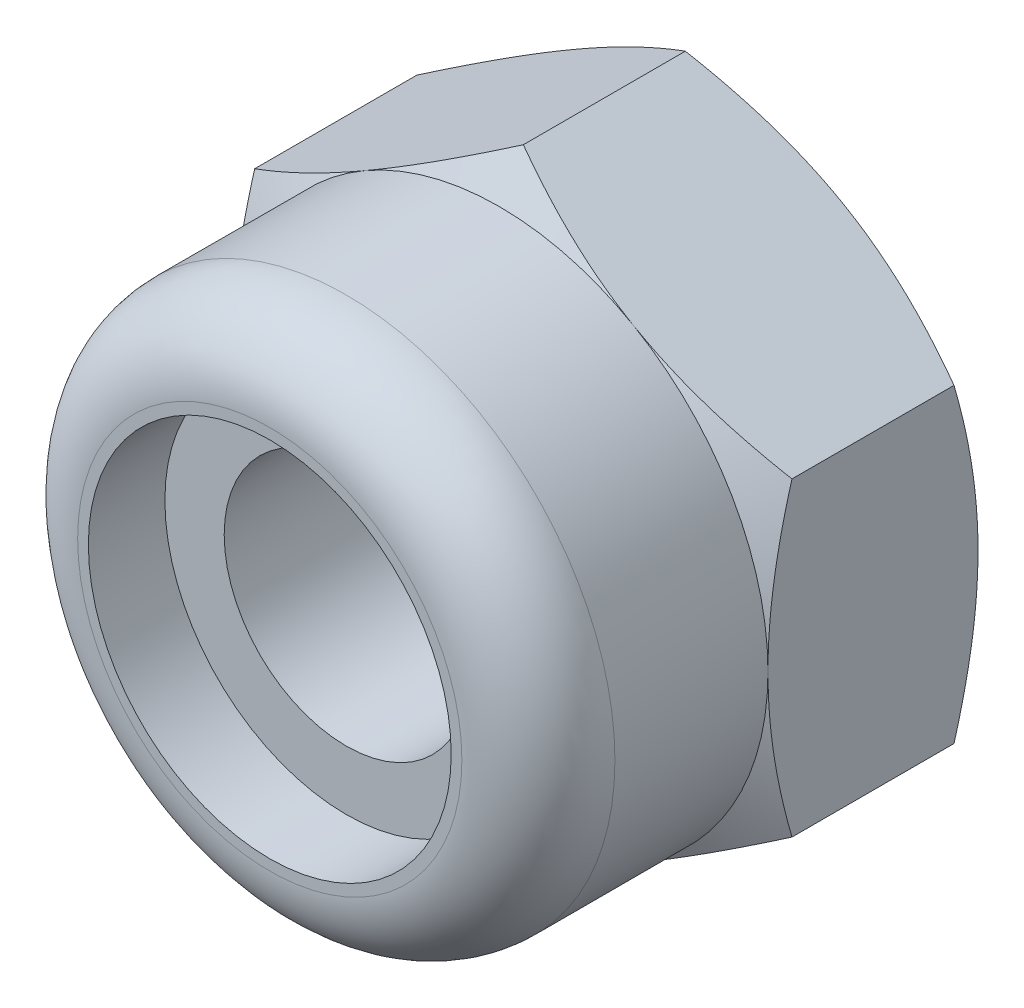
ISO-10303-21;
HEADER;
FILE_DESCRIPTION(('STEP AP214'),'2;1');
FILE_NAME('part.step','',(''),(''),'','','');
FILE_SCHEMA(('AUTOMOTIVE_DESIGN { 1 0 10303 214 1 1 1 1 }'));
ENDSEC;
DATA;
#1=APPLICATION_CONTEXT('core data for automotive mechanical design processes');
#2=APPLICATION_PROTOCOL_DEFINITION('international standard','automotive_design',2000,#1);
#3=PRODUCT_CONTEXT('',#1,'mechanical');
#4=PRODUCT('Part','Part','',(#3));
#5=PRODUCT_RELATED_PRODUCT_CATEGORY('part','',(#4));
#6=PRODUCT_DEFINITION_FORMATION('','',#4);
#7=PRODUCT_DEFINITION_CONTEXT('part definition',#1,'design');
#8=PRODUCT_DEFINITION('design','',#6,#7);
#9=PRODUCT_DEFINITION_SHAPE('','',#8);
#10=(LENGTH_UNIT() NAMED_UNIT(*) SI_UNIT(.MILLI.,.METRE.));
#11=(NAMED_UNIT(*) PLANE_ANGLE_UNIT() SI_UNIT($,.RADIAN.));
#12=(NAMED_UNIT(*) SI_UNIT($,.STERADIAN.) SOLID_ANGLE_UNIT());
#13=UNCERTAINTY_MEASURE_WITH_UNIT(LENGTH_MEASURE(1.E-05),#10,'distance_accuracy_value','');
#14=(GEOMETRIC_REPRESENTATION_CONTEXT(3) GLOBAL_UNCERTAINTY_ASSIGNED_CONTEXT((#13)) GLOBAL_UNIT_ASSIGNED_CONTEXT((#10,
#11,#12)) REPRESENTATION_CONTEXT('',''));
#15=CARTESIAN_POINT('',(0.,0.,0.));
#16=DIRECTION('',(0.,0.,1.));
#17=DIRECTION('',(1.,0.,0.));
#18=AXIS2_PLACEMENT_3D('',#15,#16,#17);
#19=CARTESIAN_POINT('',(-4.52279526300001,-0.465265331741155,0.28753924332247));
#20=DIRECTION('',(0.,0.,1.));
#21=DIRECTION('',(1.,0.,0.));
#22=AXIS2_PLACEMENT_3D('',#19,#20,#21);
#23=CYLINDRICAL_SURFACE('',#22,1.25);
#24=CARTESIAN_POINT('',(-4.52279526299978,-0.465265331740697,4.00420590998917));
#25=DIRECTION('',(0.,0.,1.));
#26=DIRECTION('',(1.,0.,0.));
#27=AXIS2_PLACEMENT_3D('',#24,#25,#26);
#28=CIRCLE('',#27,1.25);
#29=CARTESIAN_POINT('',(-3.27279526299978,-0.465265331740704,4.00420590998917));
#30=VERTEX_POINT('',#29);
#31=EDGE_CURVE('E262',#30,#30,#28,.T.);
#32=ORIENTED_EDGE('',*,*,#31,.T.);
#33=EDGE_LOOP('',(#32));
#34=FACE_BOUND('',#33,.T.);
#35=CARTESIAN_POINT('',(-4.52279526300002,-0.465265331740822,0.487991127874943));
#36=DIRECTION('',(0.,0.,-1.));
#37=DIRECTION('',(-1.,0.,0.));
#38=AXIS2_PLACEMENT_3D('',#35,#36,#37);
#39=CIRCLE('',#38,1.25);
#40=CARTESIAN_POINT('',(-5.77279526300003,-0.465265331740815,0.487991127874943));
#41=VERTEX_POINT('',#40);
#42=EDGE_CURVE('E21',#41,#41,#39,.F.);
#43=ORIENTED_EDGE('',*,*,#42,.F.);
#44=EDGE_LOOP('',(#43));
#45=FACE_BOUND('',#44,.T.);
#46=ADVANCED_FACE('F16',(#34,#45),#23,.F.);
#47=CARTESIAN_POINT('',(-4.52279526300015,2.7101611488022,0.287539243322487));
#48=DIRECTION('',(-0.500000000000012,0.866025403784441,0.));
#49=DIRECTION('',(-0.866025403784434,-0.500000000000005,0.));
#50=AXIS2_PLACEMENT_3D('',#47,#48,#49);
#51=PLANE('',#50);
#52=DIRECTION('',(0.,0.,1.));
#53=VECTOR('',#52,1.);
#54=CARTESIAN_POINT('',(-7.27279526300008,1.12244790853057,0.287539243322497));
#55=LINE('',#54,#53);
#56=CARTESIAN_POINT('',(-7.27279526300001,1.12244790853065,0.533159336384339));
#57=VERTEX_POINT('',#56);
#58=CARTESIAN_POINT('',(-7.272795263,1.12244790853071,2.19191915026062));
#59=VERTEX_POINT('',#58);
#60=EDGE_CURVE('E235',#57,#59,#55,.T.);
#61=ORIENTED_EDGE('',*,*,#60,.T.);
#62=CARTESIAN_POINT('',(-7.27299526300001,1.12233243847681,2.19185247995772));
#63=CARTESIAN_POINT('',(-7.15214604234014,1.19210476855622,2.23215158107315));
#64=CARTESIAN_POINT('',(-7.03025366037744,1.26247936809459,2.26880234072473));
#65=CARTESIAN_POINT('',(-6.78435813627221,1.40444721512929,2.33277706035258));
#66=CARTESIAN_POINT('',(-6.66035062442625,1.47604298547509,2.36007838764789));
#67=CARTESIAN_POINT('',(-6.41387246502418,1.61834721715523,2.40257749802826));
#68=CARTESIAN_POINT('',(-6.29143974441272,1.68903378135788,2.4180581246999));
#69=CARTESIAN_POINT('',(-6.04599812063124,1.83073956891846,2.43653984595246));
#70=CARTESIAN_POINT('',(-5.92299010976726,1.90175827710327,2.43955624385986));
#71=CARTESIAN_POINT('',(-5.69313647638939,2.0344643342082,2.43328609789392));
#72=CARTESIAN_POINT('',(-5.58625647174616,2.09617153365995,2.42553908904571));
#73=CARTESIAN_POINT('',(-5.37319279566542,2.2191839043997,2.40098406225803));
#74=CARTESIAN_POINT('',(-5.26700986135127,2.28048865010932,2.38416765367183));
#75=CARTESIAN_POINT('',(-5.05350677360696,2.40375471529131,2.34212732097645));
#76=CARTESIAN_POINT('',(-4.94621364685729,2.46570043090244,2.31672516263517));
#77=CARTESIAN_POINT('',(-4.73322778371607,2.5886678763206,2.25907201748243));
#78=CARTESIAN_POINT('',(-4.62753231797346,2.64969118191922,2.22683458002344));
#79=CARTESIAN_POINT('',(-4.5225952630001,2.71027661885606,2.19185247995772));
#80=B_SPLINE_CURVE_WITH_KNOTS('',3,(#62,#63,#64,#65,#66,#67,#68,#69,#70,#71,#72,#73,#74,#75,#76,
#77,#78,#79),.UNSPECIFIED.,.F.,.F.,(4,2,2,2,2,2,2,2,4),(0.,0.435912828725841,0.872873557116254,
1.29901931904661,1.72464171213559,2.09526089052924,2.46622354066363,2.84541551798549,
3.22386274754518),.UNSPECIFIED.);
#81=CARTESIAN_POINT('',(-5.89779526300013,1.91630452866622,2.43753924332248));
#82=VERTEX_POINT('',#81);
#83=EDGE_CURVE('E41',#59,#82,#80,.T.);
#84=ORIENTED_EDGE('',*,*,#83,.T.);
#85=CARTESIAN_POINT('',(-4.52279526300001,2.71016114880226,2.19191915026065));
#86=VERTEX_POINT('',#85);
#87=EDGE_CURVE('E184',#82,#86,#80,.T.);
#88=ORIENTED_EDGE('',*,*,#87,.T.);
#89=DIRECTION('',(0.,0.,1.));
#90=VECTOR('',#89,1.);
#91=CARTESIAN_POINT('',(-4.52279526300015,2.7101611488022,0.287539243322487));
#92=LINE('',#91,#90);
#93=CARTESIAN_POINT('',(-4.52279526300016,2.71016114880211,0.533159336384332));
#94=VERTEX_POINT('',#93);
#95=EDGE_CURVE('E221',#94,#86,#92,.T.);
#96=ORIENTED_EDGE('',*,*,#95,.F.);
#97=CARTESIAN_POINT('',(-7.272995263,1.12233243847676,0.533226006687242));
#98=CARTESIAN_POINT('',(-7.15214604234013,1.19210476855622,0.492926905571858));
#99=CARTESIAN_POINT('',(-7.03025366037742,1.2624793680946,0.456276145920294));
#100=CARTESIAN_POINT('',(-6.78435813627216,1.40444721512932,0.392301426292456));
#101=CARTESIAN_POINT('',(-6.66035062442618,1.47604298547511,0.365000098997142));
#102=CARTESIAN_POINT('',(-6.4138724650241,1.61834721715529,0.322500988616805));
#103=CARTESIAN_POINT('',(-6.29143974441264,1.68903378135798,0.3070203619452));
#104=CARTESIAN_POINT('',(-6.04599812063109,1.83073956891849,0.288538640692581));
#105=CARTESIAN_POINT('',(-5.92299010976704,1.90175827710319,0.285522242785084));
#106=CARTESIAN_POINT('',(-5.69313647638918,2.03446433420813,0.291792388751067));
#107=CARTESIAN_POINT('',(-5.58625647174602,2.09617153365998,0.299539397599372));
#108=CARTESIAN_POINT('',(-5.37319279566534,2.21918390439979,0.324094424387134));
#109=CARTESIAN_POINT('',(-5.26700986135119,2.28048865010938,0.34091083297331));
#110=CARTESIAN_POINT('',(-5.05350677360688,2.40375471529134,0.38295116566868));
#111=CARTESIAN_POINT('',(-4.94621364685721,2.46570043090247,0.40835332400998));
#112=CARTESIAN_POINT('',(-4.73322778371602,2.58866787632064,0.466006469162703));
#113=CARTESIAN_POINT('',(-4.62753231797342,2.64969118191927,0.498243906621648));
#114=CARTESIAN_POINT('',(-4.52259526300005,2.71027661885612,0.53322600668726));
#115=B_SPLINE_CURVE_WITH_KNOTS('',3,(#97,#98,#99,#100,#101,#102,#103,#104,#105,#106,#107,#108,
#109,#110,#111,#112,#113,#114),.UNSPECIFIED.,.F.,.F.,(4,2,2,2,2,2,2,2,4),(0.,0.435912828725867,
0.872873557116336,1.29901931904673,1.72464171213574,2.09526089052936,2.46622354066373,
2.84541551798557,3.22386274754522),.UNSPECIFIED.);
#116=CARTESIAN_POINT('',(-5.89779526300012,1.91630452866633,0.287539243322497));
#117=VERTEX_POINT('',#116);
#118=EDGE_CURVE('E237',#117,#94,#115,.T.);
#119=ORIENTED_EDGE('',*,*,#118,.F.);
#120=EDGE_CURVE('E215',#57,#117,#115,.T.);
#121=ORIENTED_EDGE('',*,*,#120,.F.);
#122=EDGE_LOOP('',(#61,#84,#88,#96,#119,#121));
#123=FACE_BOUND('',#122,.T.);
#124=ADVANCED_FACE('F18',(#123),#51,.T.);
#125=CARTESIAN_POINT('',(-1.77279526300001,1.12244790853079,0.287539243322487));
#126=DIRECTION('',(0.500000000000005,0.866025403784436,0.));
#127=DIRECTION('',(-0.866025403784435,0.500000000000014,0.));
#128=AXIS2_PLACEMENT_3D('',#125,#126,#127);
#129=PLANE('',#128);
#130=ORIENTED_EDGE('',*,*,#95,.T.);
#131=CARTESIAN_POINT('',(-4.52299526299989,2.71027661885583,2.19185247995771));
#132=CARTESIAN_POINT('',(-4.40214604233993,2.64050428877661,2.23215158107316));
#133=CARTESIAN_POINT('',(-4.28025366037721,2.57012968923831,2.26880234072475));
#134=CARTESIAN_POINT('',(-4.03435813627198,2.42816184220366,2.33277706035259));
#135=CARTESIAN_POINT('',(-3.91035062442605,2.35656607185784,2.3600783876479));
#136=CARTESIAN_POINT('',(-3.66387246502398,2.21426184017773,2.40257749802825));
#137=CARTESIAN_POINT('',(-3.54143974441251,2.14357527597513,2.41805812469988));
#138=CARTESIAN_POINT('',(-3.29599812063111,2.00186948841446,2.43653984595245));
#139=CARTESIAN_POINT('',(-3.17299010976723,1.93085078022951,2.43955624385988));
#140=CARTESIAN_POINT('',(-2.94313647638934,1.79814472312461,2.43328609789392));
#141=CARTESIAN_POINT('',(-2.83625647174603,1.73643752367298,2.42553908904569));
#142=CARTESIAN_POINT('',(-2.62319279566521,1.61342515293331,2.40098406225798));
#143=CARTESIAN_POINT('',(-2.51700986135107,1.55212040722364,2.38416765367179));
#144=CARTESIAN_POINT('',(-2.30350677360674,1.42885434204162,2.3421273209764));
#145=CARTESIAN_POINT('',(-2.19621364685704,1.36690862643051,2.3167251626351));
#146=CARTESIAN_POINT('',(-1.98322778371582,1.2439411810123,2.25907201748236));
#147=CARTESIAN_POINT('',(-1.87753231797323,1.18291787541361,2.2268345800234));
#148=CARTESIAN_POINT('',(-1.77259526299994,1.12233243847658,2.19185247995774));
#149=B_SPLINE_CURVE_WITH_KNOTS('',3,(#131,#132,#133,#134,#135,#136,#137,#138,#139,#140,#141,
#142,#143,#144,#145,#146,#147,#148),.UNSPECIFIED.,.F.,.F.,(4,2,2,2,2,2,2,2,4),(0.,
0.435912828725797,0.872873557116175,1.29901931904649,1.72464171213543,2.09526089052913,
2.46622354066357,2.84541551798547,3.2238627475452),.UNSPECIFIED.);
#150=CARTESIAN_POINT('',(-3.14779526299993,1.91630452866635,2.43753924332247));
#151=VERTEX_POINT('',#150);
#152=EDGE_CURVE('E193',#86,#151,#149,.T.);
#153=ORIENTED_EDGE('',*,*,#152,.T.);
#154=CARTESIAN_POINT('',(-1.772795263,1.12244790853064,2.19191915026063));
#155=VERTEX_POINT('',#154);
#156=EDGE_CURVE('E185',#151,#155,#149,.T.);
#157=ORIENTED_EDGE('',*,*,#156,.T.);
#158=DIRECTION('',(0.,0.,1.));
#159=VECTOR('',#158,1.);
#160=CARTESIAN_POINT('',(-1.77279526300001,1.12244790853079,0.287539243322487));
#161=LINE('',#160,#159);
#162=CARTESIAN_POINT('',(-1.772795263,1.12244790853065,0.533159336384381));
#163=VERTEX_POINT('',#162);
#164=EDGE_CURVE('E225',#163,#155,#161,.T.);
#165=ORIENTED_EDGE('',*,*,#164,.F.);
#166=CARTESIAN_POINT('',(-4.52299526299997,2.71027661885592,0.533226006687249));
#167=CARTESIAN_POINT('',(-4.40214604233999,2.64050428877664,0.492926905571915));
#168=CARTESIAN_POINT('',(-4.28025366037725,2.57012968923833,0.456276145920368));
#169=CARTESIAN_POINT('',(-4.03435813627197,2.42816184220366,0.392301426292535));
#170=CARTESIAN_POINT('',(-3.91035062442602,2.35656607185784,0.365000098997208));
#171=CARTESIAN_POINT('',(-3.66387246502394,2.21426184017768,0.322500988616852));
#172=CARTESIAN_POINT('',(-3.54143974441246,2.14357527597503,0.307020361945238));
#173=CARTESIAN_POINT('',(-3.29599812063098,2.00186948841445,0.288538640692602));
#174=CARTESIAN_POINT('',(-3.172990109767,1.93085078022963,0.285522242785096));
#175=CARTESIAN_POINT('',(-2.94313647638913,1.7981447231247,0.291792388751057));
#176=CARTESIAN_POINT('',(-2.8362564717459,1.73643752367296,0.299539397599352));
#177=CARTESIAN_POINT('',(-2.62319279566516,1.61342515293322,0.324094424387098));
#178=CARTESIAN_POINT('',(-2.51700986135101,1.55212040722359,0.340910832973269));
#179=CARTESIAN_POINT('',(-2.3035067736067,1.4288543420416,0.382951165668625));
#180=CARTESIAN_POINT('',(-2.19621364685701,1.36690862643049,0.408353324009916));
#181=CARTESIAN_POINT('',(-1.98322778371581,1.24394118101229,0.466006469162645));
#182=CARTESIAN_POINT('',(-1.87753231797322,1.18291787541363,0.498243906621607));
#183=CARTESIAN_POINT('',(-1.7725952629999,1.12233243847669,0.533226006687263));
#184=B_SPLINE_CURVE_WITH_KNOTS('',3,(#166,#167,#168,#169,#170,#171,#172,#173,#174,#175,#176,
#177,#178,#179,#180,#181,#182,#183),.UNSPECIFIED.,.F.,.F.,(4,2,2,2,2,2,2,2,4),(0.,
0.435912828725845,0.872873557116295,1.29901931904667,1.72464171213566,2.09526089052931,
2.46622354066371,2.84541551798557,3.22386274754525),.UNSPECIFIED.);
#185=CARTESIAN_POINT('',(-3.14779526299994,1.91630452866631,0.28753924332249));
#186=VERTEX_POINT('',#185);
#187=EDGE_CURVE('E206',#186,#163,#184,.T.);
#188=ORIENTED_EDGE('',*,*,#187,.F.);
#189=EDGE_CURVE('E213',#94,#186,#184,.T.);
#190=ORIENTED_EDGE('',*,*,#189,.F.);
#191=EDGE_LOOP('',(#130,#153,#157,#165,#188,#190));
#192=FACE_BOUND('',#191,.T.);
#193=ADVANCED_FACE('F196',(#192),#129,.T.);
#194=CARTESIAN_POINT('',(-1.77279526300001,1.12244790853079,0.287539243322487));
#195=DIRECTION('',(-1.,0.,0.));
#196=DIRECTION('',(0.,0.,1.));
#197=AXIS2_PLACEMENT_3D('',#194,#195,#196);
#198=PLANE('',#197);
#199=CARTESIAN_POINT('',(-1.77279526299997,-4.6761148248379,1.12159080371955));
#200=CARTESIAN_POINT('',(-1.77279526300002,-4.55537427388197,1.1799393071701));
#201=CARTESIAN_POINT('',(-1.77279526300003,-4.43434825239614,1.2377077782047));
#202=CARTESIAN_POINT('',(-1.77279526300004,-4.19157091458946,1.35175320489919));
#203=CARTESIAN_POINT('',(-1.77279526300004,-4.06981947710303,1.40802990231979));
#204=CARTESIAN_POINT('',(-1.77279526300003,-3.82477926208457,1.51905679996952));
#205=CARTESIAN_POINT('',(-1.77279526300003,-3.70148567410538,1.57379642171644));
#206=CARTESIAN_POINT('',(-1.77279526300003,-3.45388513312844,1.68092446584583));
#207=CARTESIAN_POINT('',(-1.77279526300003,-3.32957823335282,1.73331301078553));
#208=CARTESIAN_POINT('',(-1.77279526300003,-3.07821019061271,1.83573567117618));
#209=CARTESIAN_POINT('',(-1.77279526300003,-2.95113396989753,1.88573298542391));
#210=CARTESIAN_POINT('',(-1.77279526300003,-2.69548265345638,1.98181183453771));
#211=CARTESIAN_POINT('',(-1.77279526300003,-2.56690739277461,2.02789293374536));
#212=CARTESIAN_POINT('',(-1.77279526300003,-2.30831751973564,2.11490116627608));
#213=CARTESIAN_POINT('',(-1.77279526300002,-2.17830663226679,2.1558392569084));
#214=CARTESIAN_POINT('',(-1.77279526300003,-1.91643658236246,2.23123193569803));
#215=CARTESIAN_POINT('',(-1.77279526300003,-1.78457801864303,2.26568857416973));
#216=CARTESIAN_POINT('',(-1.77279526300003,-1.51892255654114,2.3264455717916));
#217=CARTESIAN_POINT('',(-1.77279526300003,-1.38512515195859,2.35274375922727));
#218=CARTESIAN_POINT('',(-1.77279526300002,-1.11591720577835,2.39541320612571));
#219=CARTESIAN_POINT('',(-1.77279526300001,-0.980506662754571,2.41178445681182));
#220=CARTESIAN_POINT('',(-1.77279526300003,-0.709638574610183,2.43315174678215));
#221=CARTESIAN_POINT('',(-1.77279526300006,-0.574186858118099,2.43821980009559));
#222=CARTESIAN_POINT('',(-1.77279526299997,-0.303378272885819,2.43671144768974));
#223=CARTESIAN_POINT('',(-1.77279526299986,-0.168021388651307,2.43013806463692));
#224=CARTESIAN_POINT('',(-1.7727952629999,0.063120104976592,2.40943511327562));
#225=CARTESIAN_POINT('',(-1.77279526299998,0.159159718396545,2.39800160229224));
#226=CARTESIAN_POINT('',(-1.77279526300004,0.350497068070582,2.37001752370906));
#227=CARTESIAN_POINT('',(-1.77279526300002,0.445794684891005,2.35346614909474));
#228=CARTESIAN_POINT('',(-1.77279526299999,0.730496855748206,2.29700388204417));
#229=CARTESIAN_POINT('',(-1.77279526300001,0.918566915644009,2.25029938390516));
#230=CARTESIAN_POINT('',(-1.77279526300001,1.1999851577339,2.16974674629188));
#231=CARTESIAN_POINT('',(-1.77279526300001,1.29480023074463,2.14073590832696));
#232=CARTESIAN_POINT('',(-1.77279526300001,1.4834407620812,2.07984359441588));
#233=CARTESIAN_POINT('',(-1.77279526300001,1.57726685379601,2.04796409844396));
#234=CARTESIAN_POINT('',(-1.772795263,1.76353707180889,1.98199782513602));
#235=CARTESIAN_POINT('',(-1.772795263,1.85598600414356,1.94792448186694));
#236=CARTESIAN_POINT('',(-1.77279526300001,2.04016658868533,1.87777787509137));
#237=CARTESIAN_POINT('',(-1.77279526300002,2.13189793365483,1.84170380328517));
#238=CARTESIAN_POINT('',(-1.77279526300006,2.2232975987925,1.80482680132503));
#239=B_SPLINE_CURVE_WITH_KNOTS('',3,(#199,#200,#201,#202,#203,#204,#205,#206,#207,#208,#209,
#210,#211,#212,#213,#214,#215,#216,#217,#218,#219,#220,#221,#222,#223,#224,#225,#226,#227,#228,
#229,#230,#231,#232,#233,#234,#235,#236,#237,#238),.UNSPECIFIED.,.F.,.F.,(4,2,2,2,2,2,2,2,2,2,2,
2,2,2,2,2,2,2,2,4),(0.,0.402305607365935,0.804680408537001,1.20935783819121,1.61401414820824,
2.02363838185777,2.43330812457357,2.84208969479609,3.25074173456645,3.65950246109152,
4.06826354901194,4.47441284024662,4.88045669141184,5.17046846817558,5.46052599902464,
6.04107275309894,6.33851131304673,6.63574613017466,6.93130791005803,7.22698998004832),.UNSPECIFIED.);
#240=CARTESIAN_POINT('',(-1.77279526300006,-2.05297857201245,2.19191915026062));
#241=VERTEX_POINT('',#240);
#242=CARTESIAN_POINT('',(-1.77279526300008,-0.465265331740822,2.43753924332249));
#243=VERTEX_POINT('',#242);
#244=EDGE_CURVE('E172',#241,#243,#239,.T.);
#245=ORIENTED_EDGE('',*,*,#244,.F.);
#246=DIRECTION('',(0.,0.,1.));
#247=VECTOR('',#246,1.);
#248=CARTESIAN_POINT('',(-1.77279526300004,-2.05297857201221,0.287539243322529));
#249=LINE('',#248,#247);
#250=CARTESIAN_POINT('',(-1.77279526300004,-2.05297857201238,0.533159336384381));
#251=VERTEX_POINT('',#250);
#252=EDGE_CURVE('E228',#251,#241,#249,.T.);
#253=ORIENTED_EDGE('',*,*,#252,.F.);
#254=CARTESIAN_POINT('',(-1.77279526299988,-4.67611482483772,1.60348768292547));
#255=CARTESIAN_POINT('',(-1.77279526299998,-4.5553742738819,1.54513917947469));
#256=CARTESIAN_POINT('',(-1.77279526300002,-4.43434825239611,1.48737070844));
#257=CARTESIAN_POINT('',(-1.77279526300005,-4.19157091458947,1.37332528174544));
#258=CARTESIAN_POINT('',(-1.77279526300004,-4.06981947710303,1.31704858432487));
#259=CARTESIAN_POINT('',(-1.77279526300003,-3.82477926208458,1.20602168667516));
#260=CARTESIAN_POINT('',(-1.77279526300003,-3.7014856741054,1.15128206492824));
#261=CARTESIAN_POINT('',(-1.77279526300003,-3.45388513312847,1.04415402079886));
#262=CARTESIAN_POINT('',(-1.77279526300003,-3.32957823335286,0.991765475859174));
#263=CARTESIAN_POINT('',(-1.77279526300003,-3.07821019061276,0.889342815468538));
#264=CARTESIAN_POINT('',(-1.77279526300003,-2.95113396989759,0.839345501220809));
#265=CARTESIAN_POINT('',(-1.77279526300003,-2.69548265345645,0.743266652107022));
#266=CARTESIAN_POINT('',(-1.77279526300003,-2.56690739277468,0.697185552899398));
#267=CARTESIAN_POINT('',(-1.77279526300002,-2.30831751973573,0.610177320368655));
#268=CARTESIAN_POINT('',(-1.77279526300001,-2.17830663226689,0.569239229736306));
#269=CARTESIAN_POINT('',(-1.77279526300004,-1.91643658236253,0.493846550946794));
#270=CARTESIAN_POINT('',(-1.77279526300007,-1.78457801864307,0.459389912475248));
#271=CARTESIAN_POINT('',(-1.77279526300007,-1.51892255654114,0.398632914853384));
#272=CARTESIAN_POINT('',(-1.77279526300004,-1.38512515195859,0.372334727417568));
#273=CARTESIAN_POINT('',(-1.77279526300001,-1.11591720577833,0.329665280519033));
#274=CARTESIAN_POINT('',(-1.77279526300001,-0.980506662754515,0.313294029832975));
#275=CARTESIAN_POINT('',(-1.77279526300002,-0.709638574610077,0.291926739862692));
#276=CARTESIAN_POINT('',(-1.77279526300003,-0.574186858117974,0.286858686549252));
#277=CARTESIAN_POINT('',(-1.772795263,-0.303378272885654,0.288367038955141));
#278=CARTESIAN_POINT('',(-1.77279526299997,-0.168021388651121,0.294940422008011));
#279=CARTESIAN_POINT('',(-1.77279526299998,0.063120104976804,0.315643373369332));
#280=CARTESIAN_POINT('',(-1.77279526300001,0.159159718396761,0.327076884352703));
#281=CARTESIAN_POINT('',(-1.77279526300002,0.350497068070804,0.355060962935896));
#282=CARTESIAN_POINT('',(-1.77279526300001,0.445794684891228,0.37161233755023));
#283=CARTESIAN_POINT('',(-1.772795263,0.730496855748431,0.428074604600848));
#284=CARTESIAN_POINT('',(-1.77279526300001,0.918566915644235,0.474779102739874));
#285=CARTESIAN_POINT('',(-1.77279526300001,1.19998515773412,0.55533174035318));
#286=CARTESIAN_POINT('',(-1.77279526300001,1.29480023074485,0.584342578318109));
#287=CARTESIAN_POINT('',(-1.77279526300001,1.48344076208143,0.645234892229205));
#288=CARTESIAN_POINT('',(-1.77279526300001,1.57726685379624,0.677114388201123));
#289=CARTESIAN_POINT('',(-1.772795263,1.76353707180912,0.743080661509085));
#290=CARTESIAN_POINT('',(-1.77279526299999,1.85598600414379,0.777154004778183));
#291=CARTESIAN_POINT('',(-1.77279526300002,2.04016658868557,0.847300611553741));
#292=CARTESIAN_POINT('',(-1.77279526300005,2.13189793365509,0.883374683359919));
#293=CARTESIAN_POINT('',(-1.77279526300013,2.22329759879279,0.920251685320003));
#294=B_SPLINE_CURVE_WITH_KNOTS('',3,(#254,#255,#256,#257,#258,#259,#260,#261,#262,#263,#264,
#265,#266,#267,#268,#269,#270,#271,#272,#273,#274,#275,#276,#277,#278,#279,#280,#281,#282,#283,
#284,#285,#286,#287,#288,#289,#290,#291,#292,#293),.UNSPECIFIED.,.F.,.F.,(4,2,2,2,2,2,2,2,2,2,2,
2,2,2,2,2,2,2,2,4),(0.,0.402305607365936,0.804680408536992,1.20935783819117,1.61401414820817,
2.02363838185767,2.43330812457345,2.84208969479596,3.25074173456632,3.65950246109147,
4.06826354901195,4.47441284024669,4.88045669141199,5.17046846817573,5.4605259990248,
6.04107275309913,6.33851131304692,6.63574613017487,6.93130791005825,7.22698998004855),.UNSPECIFIED.);
#295=CARTESIAN_POINT('',(-1.77279526300004,-0.465265331740822,0.287539243322508));
#296=VERTEX_POINT('',#295);
#297=EDGE_CURVE('E354',#251,#296,#294,.T.);
#298=ORIENTED_EDGE('',*,*,#297,.T.);
#299=EDGE_CURVE('E214',#296,#163,#294,.T.);
#300=ORIENTED_EDGE('',*,*,#299,.T.);
#301=ORIENTED_EDGE('',*,*,#164,.T.);
#302=EDGE_CURVE('E183',#243,#155,#239,.T.);
#303=ORIENTED_EDGE('',*,*,#302,.F.);
#304=EDGE_LOOP('',(#245,#253,#298,#300,#301,#303));
#305=FACE_BOUND('',#304,.T.);
#306=ADVANCED_FACE('F200',(#305),#198,.F.);
#307=CARTESIAN_POINT('',(-4.52279526300001,-3.64069181228382,0.287539243322459));
#308=DIRECTION('',(0.500000000000009,-0.866025403784439,0.));
#309=DIRECTION('',(0.866025403784434,0.500000000000005,0.));
#310=AXIS2_PLACEMENT_3D('',#307,#308,#309);
#311=PLANE('',#310);
#312=ORIENTED_EDGE('',*,*,#252,.T.);
#313=CARTESIAN_POINT('',(-1.77259526300015,-2.05286310195847,2.19185247995773));
#314=CARTESIAN_POINT('',(-1.89344448366003,-2.12263543203789,2.23215158107314));
#315=CARTESIAN_POINT('',(-2.01533686562274,-2.19301003157624,2.26880234072472));
#316=CARTESIAN_POINT('',(-2.26123238972799,-2.33497787861094,2.33277706035256));
#317=CARTESIAN_POINT('',(-2.38523990157396,-2.40657364895673,2.36007838764788));
#318=CARTESIAN_POINT('',(-2.63171806097602,-2.54887788063691,2.40257749802822));
#319=CARTESIAN_POINT('',(-2.75415078158747,-2.61956444483958,2.41805812469984));
#320=CARTESIAN_POINT('',(-2.999592405369,-2.76127023240009,2.43653984595244));
#321=CARTESIAN_POINT('',(-3.12260041623305,-2.83228894058478,2.43955624385991));
#322=CARTESIAN_POINT('',(-3.3524540496109,-2.96499499768972,2.43328609789394));
#323=CARTESIAN_POINT('',(-3.45933405425407,-3.02670219714157,2.42553908904566));
#324=CARTESIAN_POINT('',(-3.67239773033476,-3.14971456788139,2.40098406225792));
#325=CARTESIAN_POINT('',(-3.77858066464892,-3.21101931359099,2.38416765367174));
#326=CARTESIAN_POINT('',(-3.99208375239324,-3.33428537877295,2.34212732097637));
#327=CARTESIAN_POINT('',(-4.09937687914292,-3.39623109438406,2.31672516263507));
#328=CARTESIAN_POINT('',(-4.3123627422841,-3.51919853980228,2.25907201748233));
#329=CARTESIAN_POINT('',(-4.41805820802667,-3.58022184540096,2.22683458002336));
#330=CARTESIAN_POINT('',(-4.52299526299996,-3.64080728233794,2.19185247995769));
#331=B_SPLINE_CURVE_WITH_KNOTS('',3,(#313,#314,#315,#316,#317,#318,#319,#320,#321,#322,#323,
#324,#325,#326,#327,#328,#329,#330),.UNSPECIFIED.,.F.,.F.,(4,2,2,2,2,2,2,2,4),(0.,
0.435912828725844,0.872873557116281,1.29901931904664,1.72464171213563,2.09526089052927,
2.46622354066365,2.84541551798551,3.22386274754518),.UNSPECIFIED.);
#332=CARTESIAN_POINT('',(-3.14779526300009,-2.84683519214805,2.43753924332248));
#333=VERTEX_POINT('',#332);
#334=EDGE_CURVE('E348',#241,#333,#331,.T.);
#335=ORIENTED_EDGE('',*,*,#334,.T.);
#336=CARTESIAN_POINT('',(-4.52279526300009,-3.64069181228367,2.19191915026062));
#337=VERTEX_POINT('',#336);
#338=EDGE_CURVE('E165',#333,#337,#331,.T.);
#339=ORIENTED_EDGE('',*,*,#338,.T.);
#340=DIRECTION('',(0.,0.,1.));
#341=VECTOR('',#340,1.);
#342=CARTESIAN_POINT('',(-4.52279526300001,-3.64069181228382,0.287539243322459));
#343=LINE('',#342,#341);
#344=CARTESIAN_POINT('',(-4.52279526300007,-3.64069181228387,0.533159336384377));
#345=VERTEX_POINT('',#344);
#346=EDGE_CURVE('E231',#345,#337,#343,.T.);
#347=ORIENTED_EDGE('',*,*,#346,.F.);
#348=CARTESIAN_POINT('',(-1.77259526300004,-2.05286310195846,0.533226006687263));
#349=CARTESIAN_POINT('',(-1.89344448365992,-2.12263543203784,0.492926905571668));
#350=CARTESIAN_POINT('',(-2.01533686562264,-2.19301003157619,0.456276145920037));
#351=CARTESIAN_POINT('',(-2.2612323897279,-2.33497787861088,0.392301426292159));
#352=CARTESIAN_POINT('',(-2.38523990157386,-2.40657364895668,0.365000098996868));
#353=CARTESIAN_POINT('',(-2.63171806097593,-2.54887788063685,0.32250098861645));
#354=CARTESIAN_POINT('',(-2.75415078158739,-2.61956444483952,0.307020361944743));
#355=CARTESIAN_POINT('',(-2.99959240536892,-2.76127023240006,0.288538640692326));
#356=CARTESIAN_POINT('',(-3.12260041623297,-2.8322889405848,0.285522242785133));
#357=CARTESIAN_POINT('',(-3.35245404961086,-2.96499499768976,0.291792388751051));
#358=CARTESIAN_POINT('',(-3.45933405425406,-3.02670219714158,0.299539397599069));
#359=CARTESIAN_POINT('',(-3.67239773033477,-3.14971456788138,0.324094424386623));
#360=CARTESIAN_POINT('',(-3.77858066464892,-3.21101931359098,0.340910832972877));
#361=CARTESIAN_POINT('',(-3.99208375239323,-3.33428537877295,0.382951165668282));
#362=CARTESIAN_POINT('',(-4.0993768791429,-3.39623109438407,0.408353324009535));
#363=CARTESIAN_POINT('',(-4.31236274228409,-3.51919853980224,0.466006469162313));
#364=CARTESIAN_POINT('',(-4.41805820802668,-3.58022184540086,0.498243906621361));
#365=CARTESIAN_POINT('',(-4.52299526299999,-3.64080728233769,0.533226006687284));
#366=B_SPLINE_CURVE_WITH_KNOTS('',3,(#348,#349,#350,#351,#352,#353,#354,#355,#356,#357,#358,
#359,#360,#361,#362,#363,#364,#365),.UNSPECIFIED.,.F.,.F.,(4,2,2,2,2,2,2,2,4),(0.,
0.435912828725914,0.872873557116341,1.29901931904672,1.72464171213576,2.09526089052942,
2.4662235406638,2.84541551798562,3.22386274754532),.UNSPECIFIED.);
#367=CARTESIAN_POINT('',(-3.14779526300001,-2.84683519214801,0.287539243322473));
#368=VERTEX_POINT('',#367);
#369=EDGE_CURVE('E325',#368,#345,#366,.T.);
#370=ORIENTED_EDGE('',*,*,#369,.F.);
#371=EDGE_CURVE('E350',#251,#368,#366,.T.);
#372=ORIENTED_EDGE('',*,*,#371,.F.);
#373=EDGE_LOOP('',(#312,#335,#339,#347,#370,#372));
#374=FACE_BOUND('',#373,.T.);
#375=ADVANCED_FACE('F333',(#374),#311,.T.);
#376=CARTESIAN_POINT('',(-7.27279526300004,-2.05297857201236,0.28753924332248));
#377=DIRECTION('',(-0.500000000000005,-0.866025403784438,0.));
#378=DIRECTION('',(0.86602540378444,-0.50000000000001,0.));
#379=AXIS2_PLACEMENT_3D('',#376,#377,#378);
#380=PLANE('',#379);
#381=ORIENTED_EDGE('',*,*,#346,.T.);
#382=CARTESIAN_POINT('',(-4.52259526300005,-3.64080728233784,2.19185247995769));
#383=CARTESIAN_POINT('',(-4.64344448365993,-3.57103495225841,2.23215158107307));
#384=CARTESIAN_POINT('',(-4.76533686562265,-3.50066035272002,2.26880234072464));
#385=CARTESIAN_POINT('',(-5.0112323897279,-3.35869250568529,2.33277706035249));
#386=CARTESIAN_POINT('',(-5.13523990157388,-3.28709673533948,2.36007838764782));
#387=CARTESIAN_POINT('',(-5.38171806097599,-3.14479250365934,2.40257749802819));
#388=CARTESIAN_POINT('',(-5.50415078158748,-3.0741059394567,2.41805812469981));
#389=CARTESIAN_POINT('',(-5.74959240536895,-2.93240015189604,2.43653984595243));
#390=CARTESIAN_POINT('',(-5.8726004162329,-2.86138144371115,2.4395562438599));
#391=CARTESIAN_POINT('',(-6.10245404961079,-2.72867538660623,2.43328609789393));
#392=CARTESIAN_POINT('',(-6.20933405425407,-2.66696818715454,2.42553908904567));
#393=CARTESIAN_POINT('',(-6.42239773033484,-2.54395581641485,2.40098406225794));
#394=CARTESIAN_POINT('',(-6.52858066464898,-2.4826510707052,2.38416765367175));
#395=CARTESIAN_POINT('',(-6.7420837523933,-2.3593850055232,2.34212732097638));
#396=CARTESIAN_POINT('',(-6.84937687914299,-2.29743928991209,2.31672516263508));
#397=CARTESIAN_POINT('',(-7.0623627422842,-2.17447184449389,2.25907201748235));
#398=CARTESIAN_POINT('',(-7.16805820802678,-2.11344853889521,2.22683458002339));
#399=CARTESIAN_POINT('',(-7.27299526300008,-2.05286310195822,2.19185247995774));
#400=B_SPLINE_CURVE_WITH_KNOTS('',3,(#382,#383,#384,#385,#386,#387,#388,#389,#390,#391,#392,
#393,#394,#395,#396,#397,#398,#399),.UNSPECIFIED.,.F.,.F.,(4,2,2,2,2,2,2,2,4),(0.,
0.435912828725885,0.872873557116364,1.29901931904677,1.7246417121358,2.09526089052946,
2.46622354066387,2.84541551798575,3.22386274754544),.UNSPECIFIED.);
#401=CARTESIAN_POINT('',(-5.897795263,-2.84683519214811,2.4375392433225));
#402=VERTEX_POINT('',#401);
#403=EDGE_CURVE('E132',#337,#402,#400,.T.);
#404=ORIENTED_EDGE('',*,*,#403,.T.);
#405=CARTESIAN_POINT('',(-7.27279526300005,-2.05297857201231,2.19191915026067));
#406=VERTEX_POINT('',#405);
#407=EDGE_CURVE('E123',#402,#406,#400,.T.);
#408=ORIENTED_EDGE('',*,*,#407,.T.);
#409=DIRECTION('',(0.,0.,1.));
#410=VECTOR('',#409,1.);
#411=CARTESIAN_POINT('',(-7.27279526300004,-2.05297857201236,0.28753924332248));
#412=LINE('',#411,#410);
#413=CARTESIAN_POINT('',(-7.27279526300008,-2.05297857201223,0.533159336384374));
#414=VERTEX_POINT('',#413);
#415=EDGE_CURVE('E131',#414,#406,#412,.T.);
#416=ORIENTED_EDGE('',*,*,#415,.F.);
#417=CARTESIAN_POINT('',(-4.52259526299997,-3.64080728233772,0.533226006687291));
#418=CARTESIAN_POINT('',(-4.64344448365987,-3.57103495225838,0.492926905571662));
#419=CARTESIAN_POINT('',(-4.76533686562261,-3.50066035272003,0.456276145920018));
#420=CARTESIAN_POINT('',(-5.01123238972788,-3.35869250568533,0.392301426292134));
#421=CARTESIAN_POINT('',(-5.13523990157385,-3.28709673533952,0.36500009899685));
#422=CARTESIAN_POINT('',(-5.38171806097595,-3.14479250365935,0.322500988616446));
#423=CARTESIAN_POINT('',(-5.50415078158743,-3.0741059394567,0.307020361944746));
#424=CARTESIAN_POINT('',(-5.74959240536895,-2.93240015189608,0.288538640692339));
#425=CARTESIAN_POINT('',(-5.87260041623295,-2.86138144371125,0.285522242785151));
#426=CARTESIAN_POINT('',(-6.10245404961085,-2.7286753866063,0.291792388751087));
#427=CARTESIAN_POINT('',(-6.20933405425409,-2.66696818715456,0.299539397599116));
#428=CARTESIAN_POINT('',(-6.42239773033483,-2.54395581641483,0.324094424386683));
#429=CARTESIAN_POINT('',(-6.52858066464896,-2.48265107070522,0.34091083297294));
#430=CARTESIAN_POINT('',(-6.74208375239324,-2.35938500552324,0.382951165668357));
#431=CARTESIAN_POINT('',(-6.8493768791429,-2.29743928991212,0.408353324009619));
#432=CARTESIAN_POINT('',(-7.06236274228409,-2.17447184449398,0.466006469162385));
#433=CARTESIAN_POINT('',(-7.16805820802669,-2.11344853889537,0.498243906621414));
#434=CARTESIAN_POINT('',(-7.27299526300002,-2.05286310195855,0.533226006687284));
#435=B_SPLINE_CURVE_WITH_KNOTS('',3,(#417,#418,#419,#420,#421,#422,#423,#424,#425,#426,#427,
#428,#429,#430,#431,#432,#433,#434),.UNSPECIFIED.,.F.,.F.,(4,2,2,2,2,2,2,2,4),(0.,
0.435912828725946,0.872873557116405,1.29901931904682,1.72464171213589,2.09526089052953,
2.46622354066388,2.84541551798569,3.22386274754536),.UNSPECIFIED.);
#436=CARTESIAN_POINT('',(-5.89779526300003,-2.84683519214797,0.287539243322456));
#437=VERTEX_POINT('',#436);
#438=EDGE_CURVE('E312',#437,#414,#435,.T.);
#439=ORIENTED_EDGE('',*,*,#438,.F.);
#440=EDGE_CURVE('E324',#345,#437,#435,.T.);
#441=ORIENTED_EDGE('',*,*,#440,.F.);
#442=EDGE_LOOP('',(#381,#404,#408,#416,#439,#441));
#443=FACE_BOUND('',#442,.T.);
#444=ADVANCED_FACE('F330',(#443),#380,.T.);
#445=CARTESIAN_POINT('',(-7.27279526300008,1.12244790853057,0.287539243322497));
#446=DIRECTION('',(-1.,0.,0.));
#447=DIRECTION('',(0.,0.,1.));
#448=AXIS2_PLACEMENT_3D('',#445,#446,#447);
#449=PLANE('',#448);
#450=ORIENTED_EDGE('',*,*,#415,.T.);
#451=CARTESIAN_POINT('',(-7.27279526300001,-4.67611482483761,1.12159080371955));
#452=CARTESIAN_POINT('',(-7.27279526300007,-4.55537427388172,1.17993930717016));
#453=CARTESIAN_POINT('',(-7.2727952630001,-4.4343482523959,1.23770777820477));
#454=CARTESIAN_POINT('',(-7.27279526300011,-4.19157091458925,1.35175320489928));
#455=CARTESIAN_POINT('',(-7.27279526300011,-4.06981947710283,1.40802990231986));
#456=CARTESIAN_POINT('',(-7.2727952630001,-3.82477926208438,1.51905679996958));
#457=CARTESIAN_POINT('',(-7.2727952630001,-3.7014856741052,1.5737964217165));
#458=CARTESIAN_POINT('',(-7.2727952630001,-3.45388513312827,1.68092446584588));
#459=CARTESIAN_POINT('',(-7.2727952630001,-3.32957823335266,1.73331301078557));
#460=CARTESIAN_POINT('',(-7.2727952630001,-3.07821019061256,1.83573567117621));
#461=CARTESIAN_POINT('',(-7.2727952630001,-2.95113396989739,1.88573298542394));
#462=CARTESIAN_POINT('',(-7.27279526300009,-2.69548265345626,1.98181183453774));
#463=CARTESIAN_POINT('',(-7.27279526300008,-2.56690739277449,2.02789293374538));
#464=CARTESIAN_POINT('',(-7.27279526300011,-2.30831751973553,2.1149011662761));
#465=CARTESIAN_POINT('',(-7.27279526300014,-2.17830663226669,2.15583925690841));
#466=CARTESIAN_POINT('',(-7.27279526300005,-1.91643658236237,2.23123193569803));
#467=CARTESIAN_POINT('',(-7.27279526299992,-1.78457801864296,2.26568857416972));
#468=CARTESIAN_POINT('',(-7.27279526299992,-1.51892255654106,2.32644557179158));
#469=CARTESIAN_POINT('',(-7.27279526300005,-1.3851251519585,2.35274375922726));
#470=CARTESIAN_POINT('',(-7.27279526300013,-1.11591720577824,2.39541320612571));
#471=CARTESIAN_POINT('',(-7.27279526300009,-0.980506662754449,2.41178445681182));
#472=CARTESIAN_POINT('',(-7.27279526300008,-0.709638574610039,2.43315174678214));
#473=CARTESIAN_POINT('',(-7.27279526300009,-0.574186858117946,2.43821980009556));
#474=CARTESIAN_POINT('',(-7.27279526300007,-0.303378272885644,2.43671144768975));
#475=CARTESIAN_POINT('',(-7.27279526300004,-0.16802138865112,2.43013806463697));
#476=CARTESIAN_POINT('',(-7.27279526300004,0.0631201049767815,2.40943511327565));
#477=CARTESIAN_POINT('',(-7.27279526300007,0.159159718396726,2.39800160229223));
#478=CARTESIAN_POINT('',(-7.27279526300009,0.350497068070755,2.37001752370901));
#479=CARTESIAN_POINT('',(-7.27279526300008,0.445794684891177,2.3534661490947));
#480=CARTESIAN_POINT('',(-7.27279526300007,0.730496855748376,2.29700388204413));
#481=CARTESIAN_POINT('',(-7.27279526300007,0.918566915644176,2.25029938390511));
#482=CARTESIAN_POINT('',(-7.27279526300008,1.19998515773406,2.16974674629182));
#483=CARTESIAN_POINT('',(-7.27279526300008,1.29480023074479,2.1407359083269));
#484=CARTESIAN_POINT('',(-7.27279526300007,1.48344076208137,2.07984359441582));
#485=CARTESIAN_POINT('',(-7.27279526300007,1.57726685379618,2.04796409844391));
#486=CARTESIAN_POINT('',(-7.27279526300007,1.76353707180906,1.98199782513596));
#487=CARTESIAN_POINT('',(-7.27279526300008,1.85598600414372,1.94792448186687));
#488=CARTESIAN_POINT('',(-7.27279526300006,2.04016658868549,1.87777787509132));
#489=CARTESIAN_POINT('',(-7.27279526300004,2.131897933655,1.84170380328513));
#490=CARTESIAN_POINT('',(-7.27279526299998,2.22329759879268,1.80482680132503));
#491=B_SPLINE_CURVE_WITH_KNOTS('',3,(#451,#452,#453,#454,#455,#456,#457,#458,#459,#460,#461,
#462,#463,#464,#465,#466,#467,#468,#469,#470,#471,#472,#473,#474,#475,#476,#477,#478,#479,#480,
#481,#482,#483,#484,#485,#486,#487,#488,#489,#490),.UNSPECIFIED.,.F.,.F.,(4,2,2,2,2,2,2,2,2,2,2,
2,2,2,2,2,2,2,2,4),(0.,0.402305607365909,0.804680408536948,1.20935783819113,1.61401414820813,
2.02363838185764,2.43330812457342,2.84208969479591,3.25074173456624,3.65950246109135,
4.0682635490118,4.47441284024651,4.88045669141176,5.17046846817549,5.46052599902454,
6.04107275309885,6.33851131304664,6.63574613017457,6.93130791005793,7.22698998004822),.UNSPECIFIED.);
#492=CARTESIAN_POINT('',(-7.27279526299992,-0.465265331740766,2.43753924332249));
#493=VERTEX_POINT('',#492);
#494=EDGE_CURVE('E116',#406,#493,#491,.T.);
#495=ORIENTED_EDGE('',*,*,#494,.T.);
#496=EDGE_CURVE('E110',#493,#59,#491,.T.);
#497=ORIENTED_EDGE('',*,*,#496,.T.);
#498=ORIENTED_EDGE('',*,*,#60,.F.);
#499=CARTESIAN_POINT('',(-7.27279526300003,-4.67611482483753,1.60348768292545));
#500=CARTESIAN_POINT('',(-7.27279526300008,-4.55537427388172,1.54513917947465));
#501=CARTESIAN_POINT('',(-7.2727952630001,-4.43434825239594,1.48737070843996));
#502=CARTESIAN_POINT('',(-7.27279526300011,-4.19157091458931,1.3733252817454));
#503=CARTESIAN_POINT('',(-7.27279526300011,-4.06981947710287,1.31704858432484));
#504=CARTESIAN_POINT('',(-7.2727952630001,-3.82477926208442,1.20602168667514));
#505=CARTESIAN_POINT('',(-7.2727952630001,-3.70148567410525,1.15128206492822));
#506=CARTESIAN_POINT('',(-7.2727952630001,-3.45388513312833,1.04415402079885));
#507=CARTESIAN_POINT('',(-7.2727952630001,-3.32957823335272,0.991765475859164));
#508=CARTESIAN_POINT('',(-7.2727952630001,-3.07821019061263,0.889342815468534));
#509=CARTESIAN_POINT('',(-7.2727952630001,-2.95113396989746,0.839345501220808));
#510=CARTESIAN_POINT('',(-7.2727952630001,-2.69548265345634,0.743266652107028));
#511=CARTESIAN_POINT('',(-7.2727952630001,-2.56690739277457,0.697185552899407));
#512=CARTESIAN_POINT('',(-7.27279526300009,-2.30831751973562,0.610177320368669));
#513=CARTESIAN_POINT('',(-7.27279526300009,-2.17830663226679,0.56923922973632));
#514=CARTESIAN_POINT('',(-7.2727952630001,-1.91643658236243,0.493846550946821));
#515=CARTESIAN_POINT('',(-7.27279526300011,-1.78457801864297,0.459389912475287));
#516=CARTESIAN_POINT('',(-7.27279526300011,-1.51892255654104,0.398632914853427));
#517=CARTESIAN_POINT('',(-7.27279526300009,-1.38512515195849,0.372334727417604));
#518=CARTESIAN_POINT('',(-7.27279526300008,-1.11591720577822,0.329665280519066));
#519=CARTESIAN_POINT('',(-7.27279526300009,-0.980506662754406,0.313294029833011));
#520=CARTESIAN_POINT('',(-7.27279526300008,-0.709638574609963,0.291926739862738));
#521=CARTESIAN_POINT('',(-7.27279526300006,-0.574186858117858,0.286858686549305));
#522=CARTESIAN_POINT('',(-7.27279526300011,-0.303378272885534,0.288367038955183));
#523=CARTESIAN_POINT('',(-7.27279526300019,-0.168021388650998,0.294940422008036));
#524=CARTESIAN_POINT('',(-7.27279526300016,0.0631201049769135,0.315643373369366));
#525=CARTESIAN_POINT('',(-7.2727952630001,0.159159718396854,0.327076884352752));
#526=CARTESIAN_POINT('',(-7.27279526300006,0.350497068070867,0.355060962935953));
#527=CARTESIAN_POINT('',(-7.27279526300007,0.445794684891277,0.371612337550281));
#528=CARTESIAN_POINT('',(-7.27279526300009,0.730496855748439,0.428074604600883));
#529=CARTESIAN_POINT('',(-7.27279526300008,0.918566915644216,0.474779102739904));
#530=CARTESIAN_POINT('',(-7.27279526300007,1.19998515773407,0.555331740353194));
#531=CARTESIAN_POINT('',(-7.27279526300007,1.29480023074478,0.584342578318117));
#532=CARTESIAN_POINT('',(-7.27279526300007,1.48344076208133,0.645234892229201));
#533=CARTESIAN_POINT('',(-7.27279526300007,1.57726685379613,0.677114388201113));
#534=CARTESIAN_POINT('',(-7.27279526300007,1.76353707180899,0.743080661509061));
#535=CARTESIAN_POINT('',(-7.27279526300008,1.85598600414364,0.777154004778151));
#536=CARTESIAN_POINT('',(-7.27279526300006,2.0401665886854,0.847300611553698));
#537=CARTESIAN_POINT('',(-7.27279526300005,2.1318979336549,0.883374683359872));
#538=CARTESIAN_POINT('',(-7.27279526300001,2.22329759879258,0.920251685319957));
#539=B_SPLINE_CURVE_WITH_KNOTS('',3,(#499,#500,#501,#502,#503,#504,#505,#506,#507,#508,#509,
#510,#511,#512,#513,#514,#515,#516,#517,#518,#519,#520,#521,#522,#523,#524,#525,#526,#527,#528,
#529,#530,#531,#532,#533,#534,#535,#536,#537,#538),.UNSPECIFIED.,.F.,.F.,(4,2,2,2,2,2,2,2,2,2,2,
2,2,2,2,2,2,2,2,4),(0.,0.402305607365921,0.804680408536963,1.20935783819112,1.6140141482081,
2.0236383818576,2.43330812457337,2.84208969479587,3.25074173456621,3.65950246109137,
4.06826354901186,4.47441284024661,4.88045669141191,5.17046846817561,5.46052599902464,
6.04107275309888,6.33851131304663,6.63574613017453,6.93130791005786,7.22698998004813),.UNSPECIFIED.);
#540=CARTESIAN_POINT('',(-7.27279526300005,-0.465265331740808,0.287539243322515));
#541=VERTEX_POINT('',#540);
#542=EDGE_CURVE('E308',#541,#57,#539,.T.);
#543=ORIENTED_EDGE('',*,*,#542,.F.);
#544=EDGE_CURVE('E310',#414,#541,#539,.T.);
#545=ORIENTED_EDGE('',*,*,#544,.F.);
#546=EDGE_LOOP('',(#450,#495,#497,#498,#543,#545));
#547=FACE_BOUND('',#546,.T.);
#548=ADVANCED_FACE('F128',(#547),#449,.T.);
#549=CARTESIAN_POINT('',(-4.52279526300015,2.7101611488022,0.287539243322487));
#550=DIRECTION('',(0.,0.,-1.));
#551=DIRECTION('',(-1.,0.,0.));
#552=AXIS2_PLACEMENT_3D('',#549,#550,#551);
#553=PLANE('',#552);
#554=CARTESIAN_POINT('',(-4.52279526300001,-0.465265331741155,0.28753924332247));
#555=DIRECTION('',(0.,0.,-1.));
#556=DIRECTION('',(-1.,0.,0.));
#557=AXIS2_PLACEMENT_3D('',#554,#555,#556);
#558=CIRCLE('',#557,1.5);
#559=CARTESIAN_POINT('',(-6.02279526300001,-0.465265331741146,0.28753924332247));
#560=VERTEX_POINT('',#559);
#561=EDGE_CURVE('E240',#560,#560,#558,.F.);
#562=ORIENTED_EDGE('',*,*,#561,.T.);
#563=EDGE_LOOP('',(#562));
#564=FACE_BOUND('',#563,.T.);
#565=CARTESIAN_POINT('',(-4.52279526300001,-0.465265331741155,0.28753924332247));
#566=DIRECTION('',(0.,0.,-1.));
#567=DIRECTION('',(-1.,0.,0.));
#568=AXIS2_PLACEMENT_3D('',#565,#566,#567);
#569=CIRCLE('',#568,2.75);
#570=EDGE_CURVE('E126',#541,#437,#569,.F.);
#571=ORIENTED_EDGE('',*,*,#570,.F.);
#572=EDGE_CURVE('E224',#117,#541,#569,.F.);
#573=ORIENTED_EDGE('',*,*,#572,.F.);
#574=EDGE_CURVE('E239',#186,#117,#569,.F.);
#575=ORIENTED_EDGE('',*,*,#574,.F.);
#576=CARTESIAN_POINT('',(-4.52279526300001,-0.465265331741155,0.28753924332247));
#577=DIRECTION('',(0.,0.,1.));
#578=DIRECTION('',(1.,0.,0.));
#579=AXIS2_PLACEMENT_3D('',#576,#577,#578);
#580=CIRCLE('',#579,2.75);
#581=EDGE_CURVE('E194',#296,#186,#580,.T.);
#582=ORIENTED_EDGE('',*,*,#581,.F.);
#583=EDGE_CURVE('E387',#368,#296,#569,.F.);
#584=ORIENTED_EDGE('',*,*,#583,.F.);
#585=EDGE_CURVE('E379',#437,#368,#569,.F.);
#586=ORIENTED_EDGE('',*,*,#585,.F.);
#587=EDGE_LOOP('',(#571,#573,#575,#582,#584,#586));
#588=FACE_BOUND('',#587,.T.);
#589=ADVANCED_FACE('F202',(#564,#588),#553,.T.);
#590=CARTESIAN_POINT('',(-4.52279526300001,-0.465265331741155,0.28753924332247));
#591=DIRECTION('',(0.,0.,1.));
#592=DIRECTION('',(1.,0.,0.));
#593=AXIS2_PLACEMENT_3D('',#590,#591,#592);
#594=CONICAL_SURFACE('',#593,2.75,1.0471975511966);
#595=ORIENTED_EDGE('',*,*,#120,.T.);
#596=ORIENTED_EDGE('',*,*,#572,.T.);
#597=ORIENTED_EDGE('',*,*,#542,.T.);
#598=EDGE_LOOP('',(#595,#596,#597));
#599=FACE_BOUND('',#598,.T.);
#600=ADVANCED_FACE('F398',(#599),#594,.T.);
#601=ORIENTED_EDGE('',*,*,#118,.T.);
#602=ORIENTED_EDGE('',*,*,#189,.T.);
#603=ORIENTED_EDGE('',*,*,#574,.T.);
#604=EDGE_LOOP('',(#601,#602,#603));
#605=FACE_BOUND('',#604,.T.);
#606=ADVANCED_FACE('F396',(#605),#594,.T.);
#607=ORIENTED_EDGE('',*,*,#187,.T.);
#608=ORIENTED_EDGE('',*,*,#299,.F.);
#609=ORIENTED_EDGE('',*,*,#581,.T.);
#610=EDGE_LOOP('',(#607,#608,#609));
#611=FACE_BOUND('',#610,.T.);
#612=ADVANCED_FACE('F405',(#611),#594,.T.);
#613=ORIENTED_EDGE('',*,*,#371,.T.);
#614=ORIENTED_EDGE('',*,*,#583,.T.);
#615=ORIENTED_EDGE('',*,*,#297,.F.);
#616=EDGE_LOOP('',(#613,#614,#615));
#617=FACE_BOUND('',#616,.T.);
#618=ADVANCED_FACE('F400',(#617),#594,.T.);
#619=ORIENTED_EDGE('',*,*,#369,.T.);
#620=ORIENTED_EDGE('',*,*,#440,.T.);
#621=ORIENTED_EDGE('',*,*,#585,.T.);
#622=EDGE_LOOP('',(#619,#620,#621));
#623=FACE_BOUND('',#622,.T.);
#624=ADVANCED_FACE('F377',(#623),#594,.T.);
#625=ORIENTED_EDGE('',*,*,#438,.T.);
#626=ORIENTED_EDGE('',*,*,#544,.T.);
#627=ORIENTED_EDGE('',*,*,#570,.T.);
#628=EDGE_LOOP('',(#625,#626,#627));
#629=FACE_BOUND('',#628,.T.);
#630=ADVANCED_FACE('F153',(#629),#594,.T.);
#631=CARTESIAN_POINT('',(-4.52279526300004,-0.465265331740738,2.43753924332241));
#632=DIRECTION('',(0.,0.,-1.));
#633=DIRECTION('',(-1.,0.,0.));
#634=AXIS2_PLACEMENT_3D('',#631,#632,#633);
#635=CONICAL_SURFACE('',#634,2.75,1.0471975511966);
#636=CARTESIAN_POINT('',(-4.52279526300004,-0.465265331740738,2.43753924332241));
#637=DIRECTION('',(0.,0.,-1.));
#638=DIRECTION('',(-1.,0.,0.));
#639=AXIS2_PLACEMENT_3D('',#636,#637,#638);
#640=CIRCLE('',#639,2.75);
#641=EDGE_CURVE('E28',#402,#493,#640,.T.);
#642=ORIENTED_EDGE('',*,*,#641,.T.);
#643=ORIENTED_EDGE('',*,*,#494,.F.);
#644=ORIENTED_EDGE('',*,*,#407,.F.);
#645=EDGE_LOOP('',(#642,#643,#644));
#646=FACE_BOUND('',#645,.T.);
#647=ADVANCED_FACE('F121',(#646),#635,.T.);
#648=EDGE_CURVE('E125',#333,#402,#640,.T.);
#649=ORIENTED_EDGE('',*,*,#648,.T.);
#650=ORIENTED_EDGE('',*,*,#403,.F.);
#651=ORIENTED_EDGE('',*,*,#338,.F.);
#652=EDGE_LOOP('',(#649,#650,#651));
#653=FACE_BOUND('',#652,.T.);
#654=ADVANCED_FACE('F152',(#653),#635,.T.);
#655=ORIENTED_EDGE('',*,*,#244,.T.);
#656=EDGE_CURVE('E390',#243,#333,#640,.T.);
#657=ORIENTED_EDGE('',*,*,#656,.T.);
#658=ORIENTED_EDGE('',*,*,#334,.F.);
#659=EDGE_LOOP('',(#655,#657,#658));
#660=FACE_BOUND('',#659,.T.);
#661=ADVANCED_FACE('F391',(#660),#635,.T.);
#662=CARTESIAN_POINT('',(-4.52279526300004,-0.465265331740738,2.43753924332241));
#663=DIRECTION('',(0.,0.,1.));
#664=DIRECTION('',(1.,0.,0.));
#665=AXIS2_PLACEMENT_3D('',#662,#663,#664);
#666=CIRCLE('',#665,2.75);
#667=EDGE_CURVE('E117',#243,#151,#666,.T.);
#668=ORIENTED_EDGE('',*,*,#667,.F.);
#669=ORIENTED_EDGE('',*,*,#302,.T.);
#670=ORIENTED_EDGE('',*,*,#156,.F.);
#671=EDGE_LOOP('',(#668,#669,#670));
#672=FACE_BOUND('',#671,.T.);
#673=ADVANCED_FACE('F362',(#672),#635,.T.);
#674=EDGE_CURVE('E26',#82,#151,#640,.T.);
#675=ORIENTED_EDGE('',*,*,#674,.T.);
#676=ORIENTED_EDGE('',*,*,#152,.F.);
#677=ORIENTED_EDGE('',*,*,#87,.F.);
#678=EDGE_LOOP('',(#675,#676,#677));
#679=FACE_BOUND('',#678,.T.);
#680=ADVANCED_FACE('F154',(#679),#635,.T.);
#681=ORIENTED_EDGE('',*,*,#496,.F.);
#682=EDGE_CURVE('E11',#493,#82,#640,.T.);
#683=ORIENTED_EDGE('',*,*,#682,.T.);
#684=ORIENTED_EDGE('',*,*,#83,.F.);
#685=EDGE_LOOP('',(#681,#683,#684));
#686=FACE_BOUND('',#685,.T.);
#687=ADVANCED_FACE('F111',(#686),#635,.T.);
#688=CARTESIAN_POINT('',(-4.52279526299997,-0.465265331740961,0.312939243322524));
#689=DIRECTION('',(0.,0.,-1.));
#690=DIRECTION('',(-1.,0.,0.));
#691=AXIS2_PLACEMENT_3D('',#688,#689,#690);
#692=CONICAL_SURFACE('',#691,1.5,0.959931088596883);
#693=CARTESIAN_POINT('',(-4.52279526299997,-0.465265331740961,0.312939243322524));
#694=DIRECTION('',(0.,0.,1.));
#695=DIRECTION('',(1.,0.,0.));
#696=AXIS2_PLACEMENT_3D('',#693,#694,#695);
#697=CIRCLE('',#696,1.5);
#698=CARTESIAN_POINT('',(-3.02279526299996,-0.465265331740969,0.312939243322523));
#699=VERTEX_POINT('',#698);
#700=EDGE_CURVE('E242',#699,#699,#697,.T.);
#701=ORIENTED_EDGE('',*,*,#700,.F.);
#702=EDGE_LOOP('',(#701));
#703=FACE_BOUND('',#702,.T.);
#704=ORIENTED_EDGE('',*,*,#42,.T.);
#705=EDGE_LOOP('',(#704));
#706=FACE_BOUND('',#705,.T.);
#707=ADVANCED_FACE('F526',(#703,#706),#692,.F.);
#708=CARTESIAN_POINT('',(-4.52279526299994,-0.46526533174053,-22.5999664857708));
#709=DIRECTION('',(0.,0.,1.));
#710=DIRECTION('',(1.,0.,0.));
#711=AXIS2_PLACEMENT_3D('',#708,#709,#710);
#712=CYLINDRICAL_SURFACE('',#711,1.5);
#713=ORIENTED_EDGE('',*,*,#561,.F.);
#714=EDGE_LOOP('',(#713));
#715=FACE_BOUND('',#714,.T.);
#716=ORIENTED_EDGE('',*,*,#700,.T.);
#717=EDGE_LOOP('',(#716));
#718=FACE_BOUND('',#717,.T.);
#719=ADVANCED_FACE('F155',(#715,#718),#712,.F.);
#720=CARTESIAN_POINT('',(-4.52279526300007,0.784734668258943,4.00420590998916));
#721=DIRECTION('',(0.,0.,-1.));
#722=DIRECTION('',(-1.,0.,0.));
#723=AXIS2_PLACEMENT_3D('',#720,#721,#722);
#724=PLANE('',#723);
#725=ORIENTED_EDGE('',*,*,#31,.F.);
#726=EDGE_LOOP('',(#725));
#727=FACE_BOUND('',#726,.T.);
#728=CARTESIAN_POINT('',(-4.52279526299978,-0.465265331740697,4.00420590998917));
#729=DIRECTION('',(0.,0.,1.));
#730=DIRECTION('',(1.,0.,0.));
#731=AXIS2_PLACEMENT_3D('',#728,#729,#730);
#732=CIRCLE('',#731,1.85714285714286);
#733=CARTESIAN_POINT('',(-2.66565240585691,-0.465265331740707,4.00420590998917));
#734=VERTEX_POINT('',#733);
#735=EDGE_CURVE('E247',#734,#734,#732,.T.);
#736=ORIENTED_EDGE('',*,*,#735,.T.);
#737=EDGE_LOOP('',(#736));
#738=FACE_BOUND('',#737,.T.);
#739=ADVANCED_FACE('F268',(#727,#738),#724,.F.);
#740=CARTESIAN_POINT('',(-4.52279526300005,-0.465265331741058,11.918427467898));
#741=DIRECTION('',(0.,0.,1.));
#742=DIRECTION('',(1.,0.,0.));
#743=AXIS2_PLACEMENT_3D('',#740,#741,#742);
#744=CYLINDRICAL_SURFACE('',#743,1.85714285714286);
#745=ORIENTED_EDGE('',*,*,#735,.F.);
#746=EDGE_LOOP('',(#745));
#747=FACE_BOUND('',#746,.T.);
#748=CARTESIAN_POINT('',(-4.52279526300016,-0.465265331740752,4.7875392433225));
#749=DIRECTION('',(0.,0.,1.));
#750=DIRECTION('',(1.,0.,0.));
#751=AXIS2_PLACEMENT_3D('',#748,#749,#750);
#752=CIRCLE('',#751,1.85714285714286);
#753=CARTESIAN_POINT('',(-2.6656524058573,-0.465265331740763,4.7875392433225));
#754=VERTEX_POINT('',#753);
#755=EDGE_CURVE('E251',#754,#754,#752,.T.);
#756=ORIENTED_EDGE('',*,*,#755,.T.);
#757=EDGE_LOOP('',(#756));
#758=FACE_BOUND('',#757,.T.);
#759=ADVANCED_FACE('F271',(#747,#758),#744,.F.);
#760=CARTESIAN_POINT('',(-4.52279526299995,1.39187752540232,4.78753924332248));
#761=DIRECTION('',(0.,0.,-1.));
#762=DIRECTION('',(-1.,0.,0.));
#763=AXIS2_PLACEMENT_3D('',#760,#761,#762);
#764=PLANE('',#763);
#765=ORIENTED_EDGE('',*,*,#755,.F.);
#766=EDGE_LOOP('',(#765));
#767=FACE_BOUND('',#766,.T.);
#768=CARTESIAN_POINT('',(-4.52279526300016,-0.465265331740752,4.7875392433225));
#769=DIRECTION('',(0.,0.,1.));
#770=DIRECTION('',(1.,0.,0.));
#771=AXIS2_PLACEMENT_3D('',#768,#769,#770);
#772=CIRCLE('',#771,1.96666666666667);
#773=CARTESIAN_POINT('',(-2.55612859633349,-0.465265331740763,4.7875392433225));
#774=VERTEX_POINT('',#773);
#775=EDGE_CURVE('E256',#774,#774,#772,.T.);
#776=ORIENTED_EDGE('',*,*,#775,.T.);
#777=EDGE_LOOP('',(#776));
#778=FACE_BOUND('',#777,.T.);
#779=ADVANCED_FACE('F277',(#767,#778),#764,.F.);
#780=CARTESIAN_POINT('',(-4.52279526299978,-0.465265331740697,4.00420590998917));
#781=DIRECTION('',(0.,0.,1.));
#782=DIRECTION('',(1.,0.,0.));
#783=AXIS2_PLACEMENT_3D('',#780,#781,#782);
#784=TOROIDAL_SURFACE('',#783,1.96666666666667,0.783333333333333);
#785=ORIENTED_EDGE('',*,*,#775,.F.);
#786=EDGE_LOOP('',(#785));
#787=FACE_BOUND('',#786,.T.);
#788=CARTESIAN_POINT('',(-4.52279526299978,-0.465265331740697,4.00420590998917));
#789=DIRECTION('',(0.,0.,1.));
#790=DIRECTION('',(1.,0.,0.));
#791=AXIS2_PLACEMENT_3D('',#788,#789,#790);
#792=CIRCLE('',#791,2.75);
#793=CARTESIAN_POINT('',(-1.77279526299977,-0.465265331740712,4.00420590998917));
#794=VERTEX_POINT('',#793);
#795=EDGE_CURVE('E259',#794,#794,#792,.T.);
#796=ORIENTED_EDGE('',*,*,#795,.T.);
#797=EDGE_LOOP('',(#796));
#798=FACE_BOUND('',#797,.T.);
#799=ADVANCED_FACE('F283',(#787,#798),#784,.T.);
#800=CARTESIAN_POINT('',(-4.52279526300005,-0.465265331741058,11.918427467898));
#801=DIRECTION('',(0.,0.,1.));
#802=DIRECTION('',(1.,0.,0.));
#803=AXIS2_PLACEMENT_3D('',#800,#801,#802);
#804=CYLINDRICAL_SURFACE('',#803,2.75);
#805=ORIENTED_EDGE('',*,*,#641,.F.);
#806=ORIENTED_EDGE('',*,*,#648,.F.);
#807=ORIENTED_EDGE('',*,*,#656,.F.);
#808=ORIENTED_EDGE('',*,*,#667,.T.);
#809=ORIENTED_EDGE('',*,*,#674,.F.);
#810=ORIENTED_EDGE('',*,*,#682,.F.);
#811=EDGE_LOOP('',(#805,#806,#807,#808,#809,#810));
#812=FACE_BOUND('',#811,.T.);
#813=ORIENTED_EDGE('',*,*,#795,.F.);
#814=EDGE_LOOP('',(#813));
#815=FACE_BOUND('',#814,.T.);
#816=ADVANCED_FACE('F106',(#812,#815),#804,.T.);
#817=CLOSED_SHELL('',(#46,#124,#193,#306,#375,#444,#548,#589,#600,#606,#612,#618,#624,#630,#647,
#654,#661,#673,#680,#687,#707,#719,#739,#759,#779,#799,#816));
#818=MANIFOLD_SOLID_BREP('B1',#817);
#819=ADVANCED_BREP_SHAPE_REPRESENTATION('',(#18,#818),#14);
#820=SHAPE_DEFINITION_REPRESENTATION(#9,#819);
ENDSEC;
END-ISO-10303-21;
